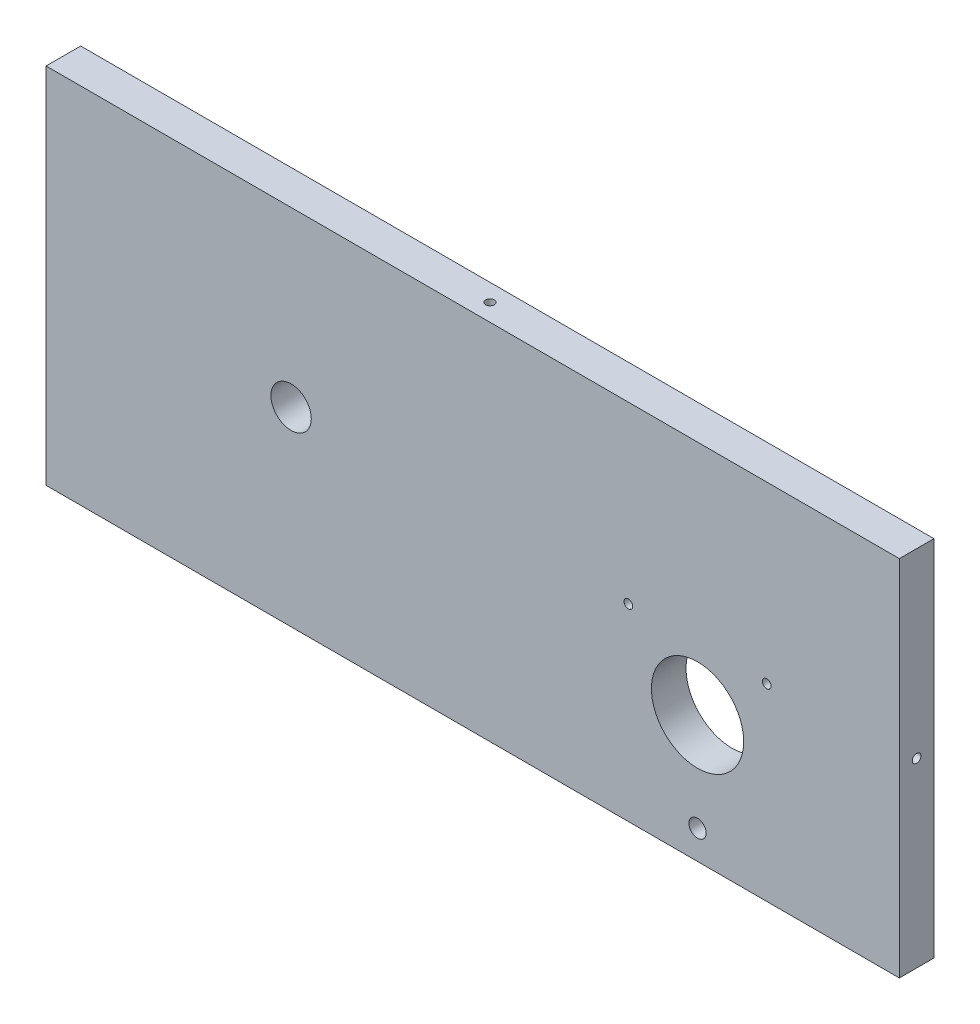
ISO-10303-21;
HEADER;
FILE_DESCRIPTION(('STEP AP214'),'2;1');
FILE_NAME('part.step','',(''),(''),'','','');
FILE_SCHEMA(('AUTOMOTIVE_DESIGN { 1 0 10303 214 1 1 1 1 }'));
ENDSEC;
DATA;
#1=APPLICATION_CONTEXT('core data for automotive mechanical design processes');
#2=APPLICATION_PROTOCOL_DEFINITION('international standard','automotive_design',2000,#1);
#3=PRODUCT_CONTEXT('',#1,'mechanical');
#4=PRODUCT('Part','Part','',(#3));
#5=PRODUCT_RELATED_PRODUCT_CATEGORY('part','',(#4));
#6=PRODUCT_DEFINITION_FORMATION('','',#4);
#7=PRODUCT_DEFINITION_CONTEXT('part definition',#1,'design');
#8=PRODUCT_DEFINITION('design','',#6,#7);
#9=PRODUCT_DEFINITION_SHAPE('','',#8);
#10=(LENGTH_UNIT() NAMED_UNIT(*) SI_UNIT(.MILLI.,.METRE.));
#11=(NAMED_UNIT(*) PLANE_ANGLE_UNIT() SI_UNIT($,.RADIAN.));
#12=(NAMED_UNIT(*) SI_UNIT($,.STERADIAN.) SOLID_ANGLE_UNIT());
#13=UNCERTAINTY_MEASURE_WITH_UNIT(LENGTH_MEASURE(1.E-05),#10,'distance_accuracy_value','');
#14=(GEOMETRIC_REPRESENTATION_CONTEXT(3) GLOBAL_UNCERTAINTY_ASSIGNED_CONTEXT((#13)) GLOBAL_UNIT_ASSIGNED_CONTEXT((#10,
#11,#12)) REPRESENTATION_CONTEXT('',''));
#15=CARTESIAN_POINT('',(0.,0.,0.));
#16=DIRECTION('',(0.,0.,1.));
#17=DIRECTION('',(1.,0.,0.));
#18=AXIS2_PLACEMENT_3D('',#15,#16,#17);
#19=CARTESIAN_POINT('',(69.4856610987963,29.6979169096378,12.));
#20=DIRECTION('',(0.,0.,-1.));
#21=DIRECTION('',(-1.,0.,0.));
#22=AXIS2_PLACEMENT_3D('',#19,#20,#21);
#23=CYLINDRICAL_SURFACE('',#22,1.5);
#24=CARTESIAN_POINT('',(69.4856610987963,29.6979169096378,12.));
#25=DIRECTION('',(0.,0.,1.));
#26=DIRECTION('',(1.,0.,0.));
#27=AXIS2_PLACEMENT_3D('',#24,#25,#26);
#28=CIRCLE('',#27,1.5);
#29=CARTESIAN_POINT('',(70.9856610987963,29.6979169096378,12.));
#30=VERTEX_POINT('',#29);
#31=EDGE_CURVE('E149',#30,#30,#28,.T.);
#32=ORIENTED_EDGE('',*,*,#31,.T.);
#33=EDGE_LOOP('',(#32));
#34=FACE_BOUND('',#33,.T.);
#35=CARTESIAN_POINT('',(69.4856610987963,29.6979169096378,1.50000000000001));
#36=DIRECTION('',(0.,0.,-1.));
#37=DIRECTION('',(-1.,0.,0.));
#38=AXIS2_PLACEMENT_3D('',#35,#36,#37);
#39=CIRCLE('',#38,1.5);
#40=CARTESIAN_POINT('',(67.9856610987963,29.6979169096378,1.50000000000001));
#41=VERTEX_POINT('',#40);
#42=EDGE_CURVE('E37',#41,#41,#39,.T.);
#43=ORIENTED_EDGE('',*,*,#42,.T.);
#44=EDGE_LOOP('',(#43));
#45=FACE_BOUND('',#44,.T.);
#46=ADVANCED_FACE('F33',(#34,#45),#23,.F.);
#47=CARTESIAN_POINT('',(117.485661098796,29.6979169096378,12.));
#48=DIRECTION('',(0.,0.,-1.));
#49=DIRECTION('',(-1.,0.,0.));
#50=AXIS2_PLACEMENT_3D('',#47,#48,#49);
#51=CYLINDRICAL_SURFACE('',#50,1.5);
#52=CARTESIAN_POINT('',(117.485661098796,29.6979169096378,12.));
#53=DIRECTION('',(0.,0.,1.));
#54=DIRECTION('',(1.,0.,0.));
#55=AXIS2_PLACEMENT_3D('',#52,#53,#54);
#56=CIRCLE('',#55,1.5);
#57=CARTESIAN_POINT('',(118.985661098796,29.6979169096378,12.));
#58=VERTEX_POINT('',#57);
#59=EDGE_CURVE('E144',#58,#58,#56,.T.);
#60=ORIENTED_EDGE('',*,*,#59,.T.);
#61=EDGE_LOOP('',(#60));
#62=FACE_BOUND('',#61,.T.);
#63=CARTESIAN_POINT('',(117.485661098796,29.6979169096378,1.50000000000001));
#64=DIRECTION('',(0.,0.,-1.));
#65=DIRECTION('',(-1.,0.,0.));
#66=AXIS2_PLACEMENT_3D('',#63,#64,#65);
#67=CIRCLE('',#66,1.5);
#68=CARTESIAN_POINT('',(115.985661098796,29.6979169096378,1.50000000000001));
#69=VERTEX_POINT('',#68);
#70=EDGE_CURVE('E109',#69,#69,#67,.T.);
#71=ORIENTED_EDGE('',*,*,#70,.T.);
#72=EDGE_LOOP('',(#71));
#73=FACE_BOUND('',#72,.T.);
#74=ADVANCED_FACE('F184',(#62,#73),#51,.F.);
#75=CARTESIAN_POINT('',(0.,0.,12.));
#76=DIRECTION('',(0.,0.,1.));
#77=DIRECTION('',(1.,0.,0.));
#78=AXIS2_PLACEMENT_3D('',#75,#76,#77);
#79=PLANE('',#78);
#80=ORIENTED_EDGE('',*,*,#59,.F.);
#81=EDGE_LOOP('',(#80));
#82=FACE_BOUND('',#81,.T.);
#83=CARTESIAN_POINT('',(-47.5143389012036,30.2979169096379,12.));
#84=DIRECTION('',(0.,0.,1.));
#85=DIRECTION('',(1.,0.,0.));
#86=AXIS2_PLACEMENT_3D('',#83,#84,#85);
#87=CIRCLE('',#86,7.);
#88=CARTESIAN_POINT('',(-40.5143389012036,30.2979169096379,12.));
#89=VERTEX_POINT('',#88);
#90=EDGE_CURVE('E153',#89,#89,#87,.T.);
#91=ORIENTED_EDGE('',*,*,#90,.F.);
#92=EDGE_LOOP('',(#91));
#93=FACE_BOUND('',#92,.T.);
#94=DIRECTION('',(0.,-1.,0.));
#95=VECTOR('',#94,1.);
#96=CARTESIAN_POINT('',(-132.514338901204,90.2979169096379,12.));
#97=LINE('',#96,#95);
#98=CARTESIAN_POINT('',(-132.514338901204,90.2979169096379,12.));
#99=VERTEX_POINT('',#98);
#100=CARTESIAN_POINT('',(-132.514338901204,-35.7020830903622,12.));
#101=VERTEX_POINT('',#100);
#102=EDGE_CURVE('E88',#99,#101,#97,.T.);
#103=ORIENTED_EDGE('',*,*,#102,.T.);
#104=DIRECTION('',(1.,0.,0.));
#105=VECTOR('',#104,1.);
#106=CARTESIAN_POINT('',(-132.514338901204,-35.7020830903622,12.));
#107=LINE('',#106,#105);
#108=CARTESIAN_POINT('',(163.485661098796,-35.7020830903621,12.));
#109=VERTEX_POINT('',#108);
#110=EDGE_CURVE('E82',#101,#109,#107,.T.);
#111=ORIENTED_EDGE('',*,*,#110,.T.);
#112=DIRECTION('',(0.,1.,0.));
#113=VECTOR('',#112,1.);
#114=CARTESIAN_POINT('',(163.485661098796,90.2979169096379,12.));
#115=LINE('',#114,#113);
#116=CARTESIAN_POINT('',(163.485661098796,90.2979169096379,12.));
#117=VERTEX_POINT('',#116);
#118=EDGE_CURVE('E86',#109,#117,#115,.T.);
#119=ORIENTED_EDGE('',*,*,#118,.T.);
#120=DIRECTION('',(-1.,0.,0.));
#121=VECTOR('',#120,1.);
#122=CARTESIAN_POINT('',(-132.514338901204,90.2979169096379,12.));
#123=LINE('',#122,#121);
#124=EDGE_CURVE('E52',#117,#99,#123,.T.);
#125=ORIENTED_EDGE('',*,*,#124,.T.);
#126=EDGE_LOOP('',(#103,#111,#119,#125));
#127=FACE_BOUND('',#126,.T.);
#128=CARTESIAN_POINT('',(93.4856610987963,8.29791690963785,12.));
#129=DIRECTION('',(0.,0.,1.));
#130=DIRECTION('',(1.,0.,0.));
#131=AXIS2_PLACEMENT_3D('',#128,#129,#130);
#132=CIRCLE('',#131,16.);
#133=CARTESIAN_POINT('',(109.485661098796,8.29791690963785,12.));
#134=VERTEX_POINT('',#133);
#135=EDGE_CURVE('E104',#134,#134,#132,.T.);
#136=ORIENTED_EDGE('',*,*,#135,.F.);
#137=EDGE_LOOP('',(#136));
#138=FACE_BOUND('',#137,.T.);
#139=ORIENTED_EDGE('',*,*,#31,.F.);
#140=EDGE_LOOP('',(#139));
#141=FACE_BOUND('',#140,.T.);
#142=CARTESIAN_POINT('',(93.4856610987964,-25.7020830903621,12.));
#143=DIRECTION('',(0.,0.,1.));
#144=DIRECTION('',(1.,0.,0.));
#145=AXIS2_PLACEMENT_3D('',#142,#143,#144);
#146=CIRCLE('',#145,3.00000000000001);
#147=CARTESIAN_POINT('',(96.4856610987964,-25.7020830903621,12.));
#148=VERTEX_POINT('',#147);
#149=EDGE_CURVE('E141',#148,#148,#146,.T.);
#150=ORIENTED_EDGE('',*,*,#149,.F.);
#151=EDGE_LOOP('',(#150));
#152=FACE_BOUND('',#151,.T.);
#153=ADVANCED_FACE('F83',(#82,#93,#127,#138,#141,#152),#79,.T.);
#154=CARTESIAN_POINT('',(0.,0.,0.));
#155=DIRECTION('',(0.,0.,1.));
#156=DIRECTION('',(1.,0.,0.));
#157=AXIS2_PLACEMENT_3D('',#154,#155,#156);
#158=PLANE('',#157);
#159=CARTESIAN_POINT('',(69.4856610987963,29.6979169096378,0.));
#160=DIRECTION('',(0.,0.,1.));
#161=DIRECTION('',(1.,0.,0.));
#162=AXIS2_PLACEMENT_3D('',#159,#160,#161);
#163=CIRCLE('',#162,3.00000000000001);
#164=CARTESIAN_POINT('',(72.4856610987963,29.6979169096378,0.));
#165=VERTEX_POINT('',#164);
#166=EDGE_CURVE('E123',#165,#165,#163,.T.);
#167=ORIENTED_EDGE('',*,*,#166,.T.);
#168=EDGE_LOOP('',(#167));
#169=FACE_BOUND('',#168,.T.);
#170=CARTESIAN_POINT('',(117.485661098796,29.6979169096378,0.));
#171=DIRECTION('',(0.,0.,1.));
#172=DIRECTION('',(1.,0.,0.));
#173=AXIS2_PLACEMENT_3D('',#170,#171,#172);
#174=CIRCLE('',#173,3.00000000000001);
#175=CARTESIAN_POINT('',(120.485661098796,29.6979169096378,0.));
#176=VERTEX_POINT('',#175);
#177=EDGE_CURVE('E112',#176,#176,#174,.T.);
#178=ORIENTED_EDGE('',*,*,#177,.T.);
#179=EDGE_LOOP('',(#178));
#180=FACE_BOUND('',#179,.T.);
#181=DIRECTION('',(0.,-1.,0.));
#182=VECTOR('',#181,1.);
#183=CARTESIAN_POINT('',(-132.514338901204,90.2979169096379,0.));
#184=LINE('',#183,#182);
#185=CARTESIAN_POINT('',(-132.514338901204,90.2979169096379,0.));
#186=VERTEX_POINT('',#185);
#187=CARTESIAN_POINT('',(-132.514338901204,-35.7020830903622,0.));
#188=VERTEX_POINT('',#187);
#189=EDGE_CURVE('E101',#186,#188,#184,.T.);
#190=ORIENTED_EDGE('',*,*,#189,.F.);
#191=DIRECTION('',(-1.,0.,0.));
#192=VECTOR('',#191,1.);
#193=CARTESIAN_POINT('',(-132.514338901204,90.2979169096379,0.));
#194=LINE('',#193,#192);
#195=CARTESIAN_POINT('',(163.485661098796,90.2979169096379,0.));
#196=VERTEX_POINT('',#195);
#197=EDGE_CURVE('E75',#196,#186,#194,.T.);
#198=ORIENTED_EDGE('',*,*,#197,.F.);
#199=DIRECTION('',(0.,1.,0.));
#200=VECTOR('',#199,1.);
#201=CARTESIAN_POINT('',(163.485661098796,90.2979169096379,0.));
#202=LINE('',#201,#200);
#203=CARTESIAN_POINT('',(163.485661098796,-35.7020830903621,0.));
#204=VERTEX_POINT('',#203);
#205=EDGE_CURVE('E69',#204,#196,#202,.T.);
#206=ORIENTED_EDGE('',*,*,#205,.F.);
#207=DIRECTION('',(1.,0.,0.));
#208=VECTOR('',#207,1.);
#209=CARTESIAN_POINT('',(-132.514338901204,-35.7020830903622,0.));
#210=LINE('',#209,#208);
#211=EDGE_CURVE('E92',#188,#204,#210,.T.);
#212=ORIENTED_EDGE('',*,*,#211,.F.);
#213=EDGE_LOOP('',(#190,#198,#206,#212));
#214=FACE_BOUND('',#213,.T.);
#215=CARTESIAN_POINT('',(93.4856610987963,8.29791690963785,0.));
#216=DIRECTION('',(0.,0.,1.));
#217=DIRECTION('',(1.,0.,0.));
#218=AXIS2_PLACEMENT_3D('',#215,#216,#217);
#219=CIRCLE('',#218,16.);
#220=CARTESIAN_POINT('',(109.485661098796,8.29791690963785,0.));
#221=VERTEX_POINT('',#220);
#222=EDGE_CURVE('E156',#221,#221,#219,.T.);
#223=ORIENTED_EDGE('',*,*,#222,.T.);
#224=EDGE_LOOP('',(#223));
#225=FACE_BOUND('',#224,.T.);
#226=CARTESIAN_POINT('',(-47.5143389012036,30.2979169096379,0.));
#227=DIRECTION('',(0.,0.,1.));
#228=DIRECTION('',(1.,0.,0.));
#229=AXIS2_PLACEMENT_3D('',#226,#227,#228);
#230=CIRCLE('',#229,7.);
#231=CARTESIAN_POINT('',(-40.5143389012036,30.2979169096379,0.));
#232=VERTEX_POINT('',#231);
#233=EDGE_CURVE('E152',#232,#232,#230,.T.);
#234=ORIENTED_EDGE('',*,*,#233,.T.);
#235=EDGE_LOOP('',(#234));
#236=FACE_BOUND('',#235,.T.);
#237=CARTESIAN_POINT('',(93.4856610987964,-25.7020830903621,0.));
#238=DIRECTION('',(0.,0.,1.));
#239=DIRECTION('',(1.,0.,0.));
#240=AXIS2_PLACEMENT_3D('',#237,#238,#239);
#241=CIRCLE('',#240,3.00000000000001);
#242=CARTESIAN_POINT('',(96.4856610987964,-25.7020830903621,0.));
#243=VERTEX_POINT('',#242);
#244=EDGE_CURVE('E138',#243,#243,#241,.T.);
#245=ORIENTED_EDGE('',*,*,#244,.T.);
#246=EDGE_LOOP('',(#245));
#247=FACE_BOUND('',#246,.T.);
#248=ADVANCED_FACE('F164',(#169,#180,#214,#225,#236,#247),#158,.F.);
#249=CARTESIAN_POINT('',(-132.514338901204,90.2979169096379,12.));
#250=DIRECTION('',(1.,0.,0.));
#251=DIRECTION('',(0.,0.,-1.));
#252=AXIS2_PLACEMENT_3D('',#249,#250,#251);
#253=PLANE('',#252);
#254=CARTESIAN_POINT('',(-132.514338901204,27.2979169096379,6.));
#255=DIRECTION('',(1.,0.,0.));
#256=DIRECTION('',(0.,0.,-1.));
#257=AXIS2_PLACEMENT_3D('',#254,#255,#256);
#258=CIRCLE('',#257,1.5);
#259=CARTESIAN_POINT('',(-132.514338901204,27.2979169096379,4.5));
#260=VERTEX_POINT('',#259);
#261=EDGE_CURVE('E111',#260,#260,#258,.T.);
#262=ORIENTED_EDGE('',*,*,#261,.T.);
#263=EDGE_LOOP('',(#262));
#264=FACE_BOUND('',#263,.T.);
#265=ORIENTED_EDGE('',*,*,#189,.T.);
#266=DIRECTION('',(0.,0.,-1.));
#267=VECTOR('',#266,1.);
#268=CARTESIAN_POINT('',(-132.514338901204,-35.7020830903622,12.));
#269=LINE('',#268,#267);
#270=EDGE_CURVE('E11',#101,#188,#269,.T.);
#271=ORIENTED_EDGE('',*,*,#270,.F.);
#272=ORIENTED_EDGE('',*,*,#102,.F.);
#273=DIRECTION('',(0.,0.,-1.));
#274=VECTOR('',#273,1.);
#275=CARTESIAN_POINT('',(-132.514338901204,90.2979169096379,12.));
#276=LINE('',#275,#274);
#277=EDGE_CURVE('E97',#99,#186,#276,.T.);
#278=ORIENTED_EDGE('',*,*,#277,.T.);
#279=EDGE_LOOP('',(#265,#271,#272,#278));
#280=FACE_BOUND('',#279,.T.);
#281=ADVANCED_FACE('F35',(#264,#280),#253,.F.);
#282=CARTESIAN_POINT('',(-132.514338901204,-35.7020830903622,12.));
#283=DIRECTION('',(0.,1.,0.));
#284=DIRECTION('',(-1.,0.,0.));
#285=AXIS2_PLACEMENT_3D('',#282,#283,#284);
#286=PLANE('',#285);
#287=ORIENTED_EDGE('',*,*,#211,.T.);
#288=DIRECTION('',(0.,0.,-1.));
#289=VECTOR('',#288,1.);
#290=CARTESIAN_POINT('',(163.485661098796,-35.7020830903621,12.));
#291=LINE('',#290,#289);
#292=EDGE_CURVE('E43',#109,#204,#291,.T.);
#293=ORIENTED_EDGE('',*,*,#292,.F.);
#294=ORIENTED_EDGE('',*,*,#110,.F.);
#295=ORIENTED_EDGE('',*,*,#270,.T.);
#296=EDGE_LOOP('',(#287,#293,#294,#295));
#297=FACE_BOUND('',#296,.T.);
#298=ADVANCED_FACE('F91',(#297),#286,.F.);
#299=CARTESIAN_POINT('',(163.485661098796,90.2979169096379,12.));
#300=DIRECTION('',(-1.,0.,0.));
#301=DIRECTION('',(0.,-1.,0.));
#302=AXIS2_PLACEMENT_3D('',#299,#300,#301);
#303=PLANE('',#302);
#304=CARTESIAN_POINT('',(163.485661098796,27.2979169096379,6.));
#305=DIRECTION('',(-1.,0.,0.));
#306=DIRECTION('',(0.,-1.,0.));
#307=AXIS2_PLACEMENT_3D('',#304,#305,#306);
#308=CIRCLE('',#307,1.5);
#309=CARTESIAN_POINT('',(163.485661098796,25.7979169096379,6.));
#310=VERTEX_POINT('',#309);
#311=EDGE_CURVE('E127',#310,#310,#308,.T.);
#312=ORIENTED_EDGE('',*,*,#311,.T.);
#313=EDGE_LOOP('',(#312));
#314=FACE_BOUND('',#313,.T.);
#315=ORIENTED_EDGE('',*,*,#205,.T.);
#316=DIRECTION('',(0.,0.,-1.));
#317=VECTOR('',#316,1.);
#318=CARTESIAN_POINT('',(163.485661098796,90.2979169096379,12.));
#319=LINE('',#318,#317);
#320=EDGE_CURVE('E93',#117,#196,#319,.T.);
#321=ORIENTED_EDGE('',*,*,#320,.F.);
#322=ORIENTED_EDGE('',*,*,#118,.F.);
#323=ORIENTED_EDGE('',*,*,#292,.T.);
#324=EDGE_LOOP('',(#315,#321,#322,#323));
#325=FACE_BOUND('',#324,.T.);
#326=ADVANCED_FACE('F95',(#314,#325),#303,.F.);
#327=CARTESIAN_POINT('',(-132.514338901204,90.2979169096379,12.));
#328=DIRECTION('',(0.,-1.,0.));
#329=DIRECTION('',(0.,0.,-1.));
#330=AXIS2_PLACEMENT_3D('',#327,#328,#329);
#331=PLANE('',#330);
#332=CARTESIAN_POINT('',(15.4856610987963,90.2979169096379,6.00000000000004));
#333=DIRECTION('',(0.,-1.,0.));
#334=DIRECTION('',(0.,0.,-1.));
#335=AXIS2_PLACEMENT_3D('',#332,#333,#334);
#336=CIRCLE('',#335,1.5);
#337=CARTESIAN_POINT('',(15.4856610987963,90.2979169096379,4.50000000000004));
#338=VERTEX_POINT('',#337);
#339=EDGE_CURVE('E132',#338,#338,#336,.T.);
#340=ORIENTED_EDGE('',*,*,#339,.T.);
#341=EDGE_LOOP('',(#340));
#342=FACE_BOUND('',#341,.T.);
#343=ORIENTED_EDGE('',*,*,#197,.T.);
#344=ORIENTED_EDGE('',*,*,#277,.F.);
#345=ORIENTED_EDGE('',*,*,#124,.F.);
#346=ORIENTED_EDGE('',*,*,#320,.T.);
#347=EDGE_LOOP('',(#343,#344,#345,#346));
#348=FACE_BOUND('',#347,.T.);
#349=ADVANCED_FACE('F170',(#342,#348),#331,.F.);
#350=CARTESIAN_POINT('',(93.4856610987963,8.29791690963785,12.));
#351=DIRECTION('',(0.,0.,-1.));
#352=DIRECTION('',(-1.,0.,0.));
#353=AXIS2_PLACEMENT_3D('',#350,#351,#352);
#354=CYLINDRICAL_SURFACE('',#353,16.);
#355=ORIENTED_EDGE('',*,*,#135,.T.);
#356=EDGE_LOOP('',(#355));
#357=FACE_BOUND('',#356,.T.);
#358=ORIENTED_EDGE('',*,*,#222,.F.);
#359=EDGE_LOOP('',(#358));
#360=FACE_BOUND('',#359,.T.);
#361=ADVANCED_FACE('F167',(#357,#360),#354,.F.);
#362=CARTESIAN_POINT('',(-47.5143389012036,30.2979169096379,12.));
#363=DIRECTION('',(0.,0.,-1.));
#364=DIRECTION('',(-1.,0.,0.));
#365=AXIS2_PLACEMENT_3D('',#362,#363,#364);
#366=CYLINDRICAL_SURFACE('',#365,7.);
#367=ORIENTED_EDGE('',*,*,#90,.T.);
#368=EDGE_LOOP('',(#367));
#369=FACE_BOUND('',#368,.T.);
#370=ORIENTED_EDGE('',*,*,#233,.F.);
#371=EDGE_LOOP('',(#370));
#372=FACE_BOUND('',#371,.T.);
#373=ADVANCED_FACE('F169',(#369,#372),#366,.F.);
#374=CARTESIAN_POINT('',(93.4856610987964,-25.7020830903621,12.));
#375=DIRECTION('',(0.,0.,-1.));
#376=DIRECTION('',(-1.,0.,0.));
#377=AXIS2_PLACEMENT_3D('',#374,#375,#376);
#378=CYLINDRICAL_SURFACE('',#377,3.00000000000001);
#379=ORIENTED_EDGE('',*,*,#149,.T.);
#380=EDGE_LOOP('',(#379));
#381=FACE_BOUND('',#380,.T.);
#382=ORIENTED_EDGE('',*,*,#244,.F.);
#383=EDGE_LOOP('',(#382));
#384=FACE_BOUND('',#383,.T.);
#385=ADVANCED_FACE('F177',(#381,#384),#378,.F.);
#386=CARTESIAN_POINT('',(15.4856610987963,70.2979169096378,6.00000000000004));
#387=DIRECTION('',(0.,1.,0.));
#388=DIRECTION('',(0.,0.,1.));
#389=AXIS2_PLACEMENT_3D('',#386,#387,#388);
#390=CYLINDRICAL_SURFACE('',#389,1.5);
#391=CARTESIAN_POINT('',(15.4856610987963,70.2979169096378,6.00000000000004));
#392=DIRECTION('',(0.,-1.,0.));
#393=DIRECTION('',(0.,0.,-1.));
#394=AXIS2_PLACEMENT_3D('',#391,#392,#393);
#395=CIRCLE('',#394,1.5);
#396=CARTESIAN_POINT('',(15.4856610987963,70.2979169096378,4.50000000000004));
#397=VERTEX_POINT('',#396);
#398=EDGE_CURVE('E135',#397,#397,#395,.T.);
#399=ORIENTED_EDGE('',*,*,#398,.T.);
#400=EDGE_LOOP('',(#399));
#401=FACE_BOUND('',#400,.T.);
#402=ORIENTED_EDGE('',*,*,#339,.F.);
#403=EDGE_LOOP('',(#402));
#404=FACE_BOUND('',#403,.T.);
#405=ADVANCED_FACE('F196',(#401,#404),#390,.F.);
#406=CARTESIAN_POINT('',(15.4856610987963,70.2979169096378,6.00000000000004));
#407=DIRECTION('',(0.,-1.,0.));
#408=DIRECTION('',(0.,0.,-1.));
#409=AXIS2_PLACEMENT_3D('',#406,#407,#408);
#410=PLANE('',#409);
#411=ORIENTED_EDGE('',*,*,#398,.F.);
#412=EDGE_LOOP('',(#411));
#413=FACE_BOUND('',#412,.T.);
#414=ADVANCED_FACE('F200',(#413),#410,.F.);
#415=CARTESIAN_POINT('',(143.485661098796,27.2979169096379,6.));
#416=DIRECTION('',(1.,0.,0.));
#417=DIRECTION('',(0.,0.,-1.));
#418=AXIS2_PLACEMENT_3D('',#415,#416,#417);
#419=CYLINDRICAL_SURFACE('',#418,1.5);
#420=CARTESIAN_POINT('',(143.485661098796,27.2979169096379,6.));
#421=DIRECTION('',(-1.,0.,0.));
#422=DIRECTION('',(0.,-1.,0.));
#423=AXIS2_PLACEMENT_3D('',#420,#421,#422);
#424=CIRCLE('',#423,1.5);
#425=CARTESIAN_POINT('',(143.485661098796,25.7979169096379,6.));
#426=VERTEX_POINT('',#425);
#427=EDGE_CURVE('E129',#426,#426,#424,.T.);
#428=ORIENTED_EDGE('',*,*,#427,.T.);
#429=EDGE_LOOP('',(#428));
#430=FACE_BOUND('',#429,.T.);
#431=ORIENTED_EDGE('',*,*,#311,.F.);
#432=EDGE_LOOP('',(#431));
#433=FACE_BOUND('',#432,.T.);
#434=ADVANCED_FACE('F204',(#430,#433),#419,.F.);
#435=CARTESIAN_POINT('',(143.485661098796,27.2979169096379,6.));
#436=DIRECTION('',(-1.,0.,0.));
#437=DIRECTION('',(0.,-1.,0.));
#438=AXIS2_PLACEMENT_3D('',#435,#436,#437);
#439=PLANE('',#438);
#440=ORIENTED_EDGE('',*,*,#427,.F.);
#441=EDGE_LOOP('',(#440));
#442=FACE_BOUND('',#441,.T.);
#443=ADVANCED_FACE('F208',(#442),#439,.F.);
#444=CARTESIAN_POINT('',(-112.514338901204,27.2979169096379,6.));
#445=DIRECTION('',(-1.,0.,0.));
#446=DIRECTION('',(0.,0.,1.));
#447=AXIS2_PLACEMENT_3D('',#444,#445,#446);
#448=CYLINDRICAL_SURFACE('',#447,1.5);
#449=CARTESIAN_POINT('',(-112.514338901204,27.2979169096379,6.));
#450=DIRECTION('',(1.,0.,0.));
#451=DIRECTION('',(0.,0.,-1.));
#452=AXIS2_PLACEMENT_3D('',#449,#450,#451);
#453=CIRCLE('',#452,1.5);
#454=CARTESIAN_POINT('',(-112.514338901204,27.2979169096379,4.5));
#455=VERTEX_POINT('',#454);
#456=EDGE_CURVE('E116',#455,#455,#453,.T.);
#457=ORIENTED_EDGE('',*,*,#456,.T.);
#458=EDGE_LOOP('',(#457));
#459=FACE_BOUND('',#458,.T.);
#460=ORIENTED_EDGE('',*,*,#261,.F.);
#461=EDGE_LOOP('',(#460));
#462=FACE_BOUND('',#461,.T.);
#463=ADVANCED_FACE('F212',(#459,#462),#448,.F.);
#464=CARTESIAN_POINT('',(-112.514338901204,27.2979169096379,6.));
#465=DIRECTION('',(1.,0.,0.));
#466=DIRECTION('',(0.,0.,-1.));
#467=AXIS2_PLACEMENT_3D('',#464,#465,#466);
#468=PLANE('',#467);
#469=ORIENTED_EDGE('',*,*,#456,.F.);
#470=EDGE_LOOP('',(#469));
#471=FACE_BOUND('',#470,.T.);
#472=ADVANCED_FACE('F216',(#471),#468,.F.);
#473=CARTESIAN_POINT('',(117.485661098796,29.6979169096378,0.));
#474=DIRECTION('',(0.,0.,-1.));
#475=DIRECTION('',(1.,0.,0.));
#476=AXIS2_PLACEMENT_3D('',#473,#474,#475);
#477=CONICAL_SURFACE('',#476,3.00000000000001,0.78539816339745);
#478=ORIENTED_EDGE('',*,*,#70,.F.);
#479=EDGE_LOOP('',(#478));
#480=FACE_BOUND('',#479,.T.);
#481=ORIENTED_EDGE('',*,*,#177,.F.);
#482=EDGE_LOOP('',(#481));
#483=FACE_BOUND('',#482,.T.);
#484=ADVANCED_FACE('F220',(#480,#483),#477,.F.);
#485=CARTESIAN_POINT('',(69.4856610987963,29.6979169096378,0.));
#486=DIRECTION('',(0.,0.,-1.));
#487=DIRECTION('',(1.,0.,0.));
#488=AXIS2_PLACEMENT_3D('',#485,#486,#487);
#489=CONICAL_SURFACE('',#488,3.00000000000001,0.78539816339745);
#490=ORIENTED_EDGE('',*,*,#42,.F.);
#491=EDGE_LOOP('',(#490));
#492=FACE_BOUND('',#491,.T.);
#493=ORIENTED_EDGE('',*,*,#166,.F.);
#494=EDGE_LOOP('',(#493));
#495=FACE_BOUND('',#494,.T.);
#496=ADVANCED_FACE('F224',(#492,#495),#489,.F.);
#497=CLOSED_SHELL('',(#46,#74,#153,#248,#281,#298,#326,#349,#361,#373,#385,#405,#414,#434,#443,
#463,#472,#484,#496));
#498=MANIFOLD_SOLID_BREP('B2',#497);
#499=ADVANCED_BREP_SHAPE_REPRESENTATION('',(#18,#498),#14);
#500=SHAPE_DEFINITION_REPRESENTATION(#9,#499);
ENDSEC;
END-ISO-10303-21;
